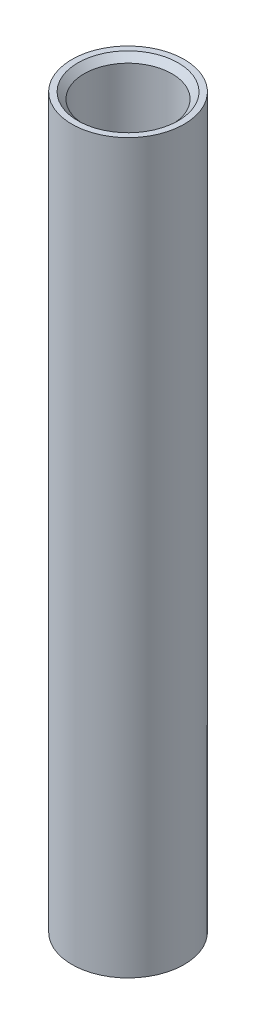
ISO-10303-21;
HEADER;
FILE_DESCRIPTION(('STEP AP214'),'2;1');
FILE_NAME('part.step','',(''),(''),'','','');
FILE_SCHEMA(('AUTOMOTIVE_DESIGN { 1 0 10303 214 1 1 1 1 }'));
ENDSEC;
DATA;
#1=APPLICATION_CONTEXT('core data for automotive mechanical design processes');
#2=APPLICATION_PROTOCOL_DEFINITION('international standard','automotive_design',2000,#1);
#3=PRODUCT_CONTEXT('',#1,'mechanical');
#4=PRODUCT('Part','Part','',(#3));
#5=PRODUCT_RELATED_PRODUCT_CATEGORY('part','',(#4));
#6=PRODUCT_DEFINITION_FORMATION('','',#4);
#7=PRODUCT_DEFINITION_CONTEXT('part definition',#1,'design');
#8=PRODUCT_DEFINITION('design','',#6,#7);
#9=PRODUCT_DEFINITION_SHAPE('','',#8);
#10=(LENGTH_UNIT() NAMED_UNIT(*) SI_UNIT(.MILLI.,.METRE.));
#11=(NAMED_UNIT(*) PLANE_ANGLE_UNIT() SI_UNIT($,.RADIAN.));
#12=(NAMED_UNIT(*) SI_UNIT($,.STERADIAN.) SOLID_ANGLE_UNIT());
#13=UNCERTAINTY_MEASURE_WITH_UNIT(LENGTH_MEASURE(1.E-05),#10,'distance_accuracy_value','');
#14=(GEOMETRIC_REPRESENTATION_CONTEXT(3) GLOBAL_UNCERTAINTY_ASSIGNED_CONTEXT((#13)) GLOBAL_UNIT_ASSIGNED_CONTEXT((#10,
#11,#12)) REPRESENTATION_CONTEXT('',''));
#15=CARTESIAN_POINT('',(0.,0.,0.));
#16=DIRECTION('',(0.,0.,1.));
#17=DIRECTION('',(1.,0.,0.));
#18=AXIS2_PLACEMENT_3D('',#15,#16,#17);
#19=CARTESIAN_POINT('',(0.,0.,0.));
#20=DIRECTION('',(0.,-1.,0.));
#21=DIRECTION('',(0.,0.,-1.));
#22=AXIS2_PLACEMENT_3D('',#19,#20,#21);
#23=CYLINDRICAL_SURFACE('',#22,3.5);
#24=CARTESIAN_POINT('',(0.,-0.499939839289499,0.));
#25=DIRECTION('',(0.,1.,0.));
#26=DIRECTION('',(-1.,0.,0.));
#27=AXIS2_PLACEMENT_3D('',#24,#25,#26);
#28=CIRCLE('',#27,3.5);
#29=CARTESIAN_POINT('',(-3.5,-0.499939839289499,0.));
#30=VERTEX_POINT('',#29);
#31=EDGE_CURVE('E33',#30,#30,#28,.T.);
#32=ORIENTED_EDGE('',*,*,#31,.T.);
#33=EDGE_LOOP('',(#32));
#34=FACE_BOUND('',#33,.T.);
#35=CARTESIAN_POINT('',(0.,-57.5000601607032,0.));
#36=DIRECTION('',(0.,-1.,0.));
#37=DIRECTION('',(0.,0.,-1.));
#38=AXIS2_PLACEMENT_3D('',#35,#36,#37);
#39=CIRCLE('',#38,3.5);
#40=CARTESIAN_POINT('',(0.,-57.5000601607032,-3.5));
#41=VERTEX_POINT('',#40);
#42=EDGE_CURVE('E17',#41,#41,#39,.T.);
#43=ORIENTED_EDGE('',*,*,#42,.T.);
#44=EDGE_LOOP('',(#43));
#45=FACE_BOUND('',#44,.T.);
#46=ADVANCED_FACE('F14',(#34,#45),#23,.F.);
#47=CARTESIAN_POINT('',(0.,-58.0000293015814,0.));
#48=DIRECTION('',(0.,-1.,0.));
#49=DIRECTION('',(0.,0.,-1.));
#50=AXIS2_PLACEMENT_3D('',#47,#48,#49);
#51=CONICAL_SURFACE('',#50,3.99996054721896,0.785389569133922);
#52=ORIENTED_EDGE('',*,*,#42,.F.);
#53=EDGE_LOOP('',(#52));
#54=FACE_BOUND('',#53,.T.);
#55=CARTESIAN_POINT('',(0.,-58.,0.));
#56=DIRECTION('',(0.,-1.,0.));
#57=DIRECTION('',(0.,0.,-1.));
#58=AXIS2_PLACEMENT_3D('',#55,#56,#57);
#59=CIRCLE('',#58,3.99993124614118);
#60=CARTESIAN_POINT('',(0.,-58.,-3.99993124614118));
#61=VERTEX_POINT('',#60);
#62=EDGE_CURVE('E31',#61,#61,#59,.F.);
#63=ORIENTED_EDGE('',*,*,#62,.F.);
#64=EDGE_LOOP('',(#63));
#65=FACE_BOUND('',#64,.T.);
#66=ADVANCED_FACE('F41',(#54,#65),#51,.F.);
#67=CARTESIAN_POINT('',(0.,2.93015887109505E-05,0.));
#68=DIRECTION('',(0.,1.,0.));
#69=DIRECTION('',(-1.,0.,0.));
#70=AXIS2_PLACEMENT_3D('',#67,#68,#69);
#71=CONICAL_SURFACE('',#70,3.99996054721896,0.785389569133921);
#72=ORIENTED_EDGE('',*,*,#31,.F.);
#73=EDGE_LOOP('',(#72));
#74=FACE_BOUND('',#73,.T.);
#75=CARTESIAN_POINT('',(0.,0.,0.));
#76=DIRECTION('',(0.,-1.,0.));
#77=DIRECTION('',(0.,0.,-1.));
#78=AXIS2_PLACEMENT_3D('',#75,#76,#77);
#79=CIRCLE('',#78,3.9999312461339);
#80=CARTESIAN_POINT('',(0.,0.,-3.9999312461339));
#81=VERTEX_POINT('',#80);
#82=EDGE_CURVE('E26',#81,#81,#79,.F.);
#83=ORIENTED_EDGE('',*,*,#82,.T.);
#84=EDGE_LOOP('',(#83));
#85=FACE_BOUND('',#84,.T.);
#86=ADVANCED_FACE('F44',(#74,#85),#71,.F.);
#87=CARTESIAN_POINT('',(0.,-58.,0.));
#88=DIRECTION('',(0.,-1.,0.));
#89=DIRECTION('',(0.,0.,-1.));
#90=AXIS2_PLACEMENT_3D('',#87,#88,#89);
#91=PLANE('',#90);
#92=ORIENTED_EDGE('',*,*,#62,.T.);
#93=EDGE_LOOP('',(#92));
#94=FACE_BOUND('',#93,.T.);
#95=CARTESIAN_POINT('',(0.,-58.,0.));
#96=DIRECTION('',(0.,-1.,0.));
#97=DIRECTION('',(0.,0.,-1.));
#98=AXIS2_PLACEMENT_3D('',#95,#96,#97);
#99=CIRCLE('',#98,4.475);
#100=CARTESIAN_POINT('',(0.,-58.,-4.475));
#101=VERTEX_POINT('',#100);
#102=EDGE_CURVE('E21',#101,#101,#99,.F.);
#103=ORIENTED_EDGE('',*,*,#102,.F.);
#104=EDGE_LOOP('',(#103));
#105=FACE_BOUND('',#104,.T.);
#106=ADVANCED_FACE('F47',(#94,#105),#91,.T.);
#107=CARTESIAN_POINT('',(0.,0.,0.));
#108=DIRECTION('',(0.,-1.,0.));
#109=DIRECTION('',(0.,0.,-1.));
#110=AXIS2_PLACEMENT_3D('',#107,#108,#109);
#111=PLANE('',#110);
#112=ORIENTED_EDGE('',*,*,#82,.F.);
#113=EDGE_LOOP('',(#112));
#114=FACE_BOUND('',#113,.T.);
#115=CARTESIAN_POINT('',(0.,0.,0.));
#116=DIRECTION('',(0.,-1.,0.));
#117=DIRECTION('',(0.,0.,-1.));
#118=AXIS2_PLACEMENT_3D('',#115,#116,#117);
#119=CIRCLE('',#118,4.475);
#120=CARTESIAN_POINT('',(0.,0.,-4.475));
#121=VERTEX_POINT('',#120);
#122=EDGE_CURVE('E10',#121,#121,#119,.T.);
#123=ORIENTED_EDGE('',*,*,#122,.F.);
#124=EDGE_LOOP('',(#123));
#125=FACE_BOUND('',#124,.T.);
#126=ADVANCED_FACE('F50',(#114,#125),#111,.F.);
#127=CARTESIAN_POINT('',(0.,0.,0.));
#128=DIRECTION('',(0.,-1.,0.));
#129=DIRECTION('',(0.,0.,-1.));
#130=AXIS2_PLACEMENT_3D('',#127,#128,#129);
#131=CYLINDRICAL_SURFACE('',#130,4.475);
#132=ORIENTED_EDGE('',*,*,#102,.T.);
#133=EDGE_LOOP('',(#132));
#134=FACE_BOUND('',#133,.T.);
#135=ORIENTED_EDGE('',*,*,#122,.T.);
#136=EDGE_LOOP('',(#135));
#137=FACE_BOUND('',#136,.T.);
#138=ADVANCED_FACE('F54',(#134,#137),#131,.T.);
#139=CLOSED_SHELL('',(#46,#66,#86,#106,#126,#138));
#140=MANIFOLD_SOLID_BREP('B1',#139);
#141=ADVANCED_BREP_SHAPE_REPRESENTATION('',(#18,#140),#14);
#142=SHAPE_DEFINITION_REPRESENTATION(#9,#141);
ENDSEC;
END-ISO-10303-21;
